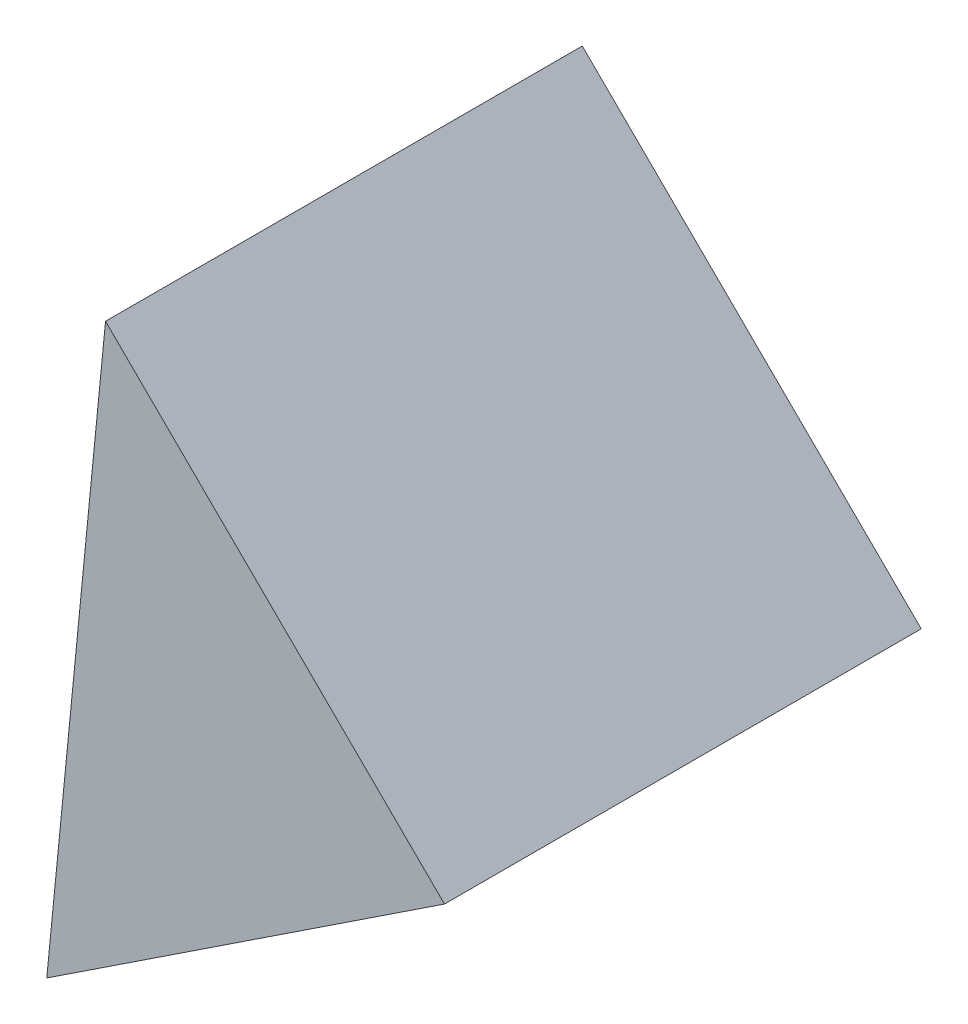
ISO-10303-21;
HEADER;
FILE_DESCRIPTION(('STEP AP214'),'2;1');
FILE_NAME('part.step','',(''),(''),'','','');
FILE_SCHEMA(('AUTOMOTIVE_DESIGN { 1 0 10303 214 1 1 1 1 }'));
ENDSEC;
DATA;
#1=APPLICATION_CONTEXT('core data for automotive mechanical design processes');
#2=APPLICATION_PROTOCOL_DEFINITION('international standard','automotive_design',2000,#1);
#3=PRODUCT_CONTEXT('',#1,'mechanical');
#4=PRODUCT('Part','Part','',(#3));
#5=PRODUCT_RELATED_PRODUCT_CATEGORY('part','',(#4));
#6=PRODUCT_DEFINITION_FORMATION('','',#4);
#7=PRODUCT_DEFINITION_CONTEXT('part definition',#1,'design');
#8=PRODUCT_DEFINITION('design','',#6,#7);
#9=PRODUCT_DEFINITION_SHAPE('','',#8);
#10=(LENGTH_UNIT() NAMED_UNIT(*) SI_UNIT(.MILLI.,.METRE.));
#11=(NAMED_UNIT(*) PLANE_ANGLE_UNIT() SI_UNIT($,.RADIAN.));
#12=(NAMED_UNIT(*) SI_UNIT($,.STERADIAN.) SOLID_ANGLE_UNIT());
#13=UNCERTAINTY_MEASURE_WITH_UNIT(LENGTH_MEASURE(1.E-05),#10,'distance_accuracy_value','');
#14=(GEOMETRIC_REPRESENTATION_CONTEXT(3) GLOBAL_UNCERTAINTY_ASSIGNED_CONTEXT((#13)) GLOBAL_UNIT_ASSIGNED_CONTEXT((#10,
#11,#12)) REPRESENTATION_CONTEXT('',''));
#15=CARTESIAN_POINT('',(0.,0.,0.));
#16=DIRECTION('',(0.,0.,1.));
#17=DIRECTION('',(1.,0.,0.));
#18=AXIS2_PLACEMENT_3D('',#15,#16,#17);
#19=CARTESIAN_POINT('',(11.1141708210114,7.73999018006656,12.5));
#20=DIRECTION('',(-0.551401526003401,0.834239987726026,0.));
#21=DIRECTION('',(-0.834239987726026,-0.551401526003401,0.));
#22=AXIS2_PLACEMENT_3D('',#19,#20,#21);
#23=PLANE('',#22);
#24=DIRECTION('',(0.834239987726026,0.551401526003401,0.));
#25=VECTOR('',#24,1.);
#26=CARTESIAN_POINT('',(11.1141708210114,7.73999018006656,0.));
#27=LINE('',#26,#25);
#28=CARTESIAN_POINT('',(0.686170974436035,0.847471105024041,0.));
#29=VERTEX_POINT('',#28);
#30=CARTESIAN_POINT('',(11.1141708210114,7.73999018006656,0.));
#31=VERTEX_POINT('',#30);
#32=EDGE_CURVE('E82',#29,#31,#27,.T.);
#33=ORIENTED_EDGE('',*,*,#32,.T.);
#34=DIRECTION('',(0.,0.,-1.));
#35=VECTOR('',#34,1.);
#36=CARTESIAN_POINT('',(11.1141708210114,7.73999018006656,12.5));
#37=LINE('',#36,#35);
#38=CARTESIAN_POINT('',(11.1141708210114,7.73999018006656,12.5));
#39=VERTEX_POINT('',#38);
#40=EDGE_CURVE('E11',#39,#31,#37,.T.);
#41=ORIENTED_EDGE('',*,*,#40,.F.);
#42=DIRECTION('',(0.834239987726026,0.551401526003401,0.));
#43=VECTOR('',#42,1.);
#44=CARTESIAN_POINT('',(11.1141708210114,7.73999018006656,12.5));
#45=LINE('',#44,#43);
#46=CARTESIAN_POINT('',(0.686170974436035,0.847471105024041,12.5));
#47=VERTEX_POINT('',#46);
#48=EDGE_CURVE('E75',#47,#39,#45,.T.);
#49=ORIENTED_EDGE('',*,*,#48,.F.);
#50=DIRECTION('',(0.,0.,-1.));
#51=VECTOR('',#50,1.);
#52=CARTESIAN_POINT('',(0.686170974436035,0.847471105024041,12.5));
#53=LINE('',#52,#51);
#54=EDGE_CURVE('E83',#47,#29,#53,.T.);
#55=ORIENTED_EDGE('',*,*,#54,.T.);
#56=EDGE_LOOP('',(#33,#41,#49,#55));
#57=FACE_BOUND('',#56,.T.);
#58=ADVANCED_FACE('F35',(#57),#23,.F.);
#59=CARTESIAN_POINT('',(11.1141708210114,7.73999018006656,12.5));
#60=DIRECTION('',(-0.703219485005664,-0.710972823607463,0.));
#61=DIRECTION('',(0.710972823607463,-0.703219485005664,0.));
#62=AXIS2_PLACEMENT_3D('',#59,#60,#61);
#63=PLANE('',#62);
#64=DIRECTION('',(-0.710972823607463,0.703219485005664,0.));
#65=VECTOR('',#64,1.);
#66=CARTESIAN_POINT('',(11.1141708210114,7.73999018006656,0.));
#67=LINE('',#66,#65);
#68=CARTESIAN_POINT('',(2.22701052591808,16.5302337426374,0.));
#69=VERTEX_POINT('',#68);
#70=EDGE_CURVE('E63',#31,#69,#67,.T.);
#71=ORIENTED_EDGE('',*,*,#70,.T.);
#72=DIRECTION('',(0.,0.,-1.));
#73=VECTOR('',#72,1.);
#74=CARTESIAN_POINT('',(2.22701052591808,16.5302337426374,12.5));
#75=LINE('',#74,#73);
#76=CARTESIAN_POINT('',(2.22701052591808,16.5302337426374,12.5));
#77=VERTEX_POINT('',#76);
#78=EDGE_CURVE('E43',#77,#69,#75,.T.);
#79=ORIENTED_EDGE('',*,*,#78,.F.);
#80=DIRECTION('',(-0.710972823607463,0.703219485005664,0.));
#81=VECTOR('',#80,1.);
#82=CARTESIAN_POINT('',(11.1141708210114,7.73999018006656,12.5));
#83=LINE('',#82,#81);
#84=EDGE_CURVE('E71',#39,#77,#83,.T.);
#85=ORIENTED_EDGE('',*,*,#84,.F.);
#86=ORIENTED_EDGE('',*,*,#40,.T.);
#87=EDGE_LOOP('',(#71,#79,#85,#86));
#88=FACE_BOUND('',#87,.T.);
#89=ADVANCED_FACE('F72',(#88),#63,.F.);
#90=CARTESIAN_POINT('',(0.686170974436035,0.847471105024041,12.5));
#91=DIRECTION('',(0.995208082962372,-0.0977797095841539,0.));
#92=DIRECTION('',(0.0977797095841539,0.995208082962372,0.));
#93=AXIS2_PLACEMENT_3D('',#90,#91,#92);
#94=PLANE('',#93);
#95=DIRECTION('',(-0.0977797095841539,-0.995208082962372,0.));
#96=VECTOR('',#95,1.);
#97=CARTESIAN_POINT('',(0.686170974436035,0.847471105024041,0.));
#98=LINE('',#97,#96);
#99=EDGE_CURVE('E68',#69,#29,#98,.T.);
#100=ORIENTED_EDGE('',*,*,#99,.T.);
#101=ORIENTED_EDGE('',*,*,#54,.F.);
#102=DIRECTION('',(-0.0977797095841539,-0.995208082962372,0.));
#103=VECTOR('',#102,1.);
#104=CARTESIAN_POINT('',(0.686170974436035,0.847471105024041,12.5));
#105=LINE('',#104,#103);
#106=EDGE_CURVE('E51',#77,#47,#105,.T.);
#107=ORIENTED_EDGE('',*,*,#106,.F.);
#108=ORIENTED_EDGE('',*,*,#78,.T.);
#109=EDGE_LOOP('',(#100,#101,#107,#108));
#110=FACE_BOUND('',#109,.T.);
#111=ADVANCED_FACE('F90',(#110),#94,.F.);
#112=CARTESIAN_POINT('',(0.,0.,12.5));
#113=DIRECTION('',(0.,0.,-1.));
#114=DIRECTION('',(-1.,0.,0.));
#115=AXIS2_PLACEMENT_3D('',#112,#113,#114);
#116=PLANE('',#115);
#117=ORIENTED_EDGE('',*,*,#48,.T.);
#118=ORIENTED_EDGE('',*,*,#84,.T.);
#119=ORIENTED_EDGE('',*,*,#106,.T.);
#120=EDGE_LOOP('',(#117,#118,#119));
#121=FACE_BOUND('',#120,.T.);
#122=ADVANCED_FACE('F78',(#121),#116,.F.);
#123=CARTESIAN_POINT('',(0.,0.,0.));
#124=DIRECTION('',(0.,0.,-1.));
#125=DIRECTION('',(-1.,0.,0.));
#126=AXIS2_PLACEMENT_3D('',#123,#124,#125);
#127=PLANE('',#126);
#128=ORIENTED_EDGE('',*,*,#32,.F.);
#129=ORIENTED_EDGE('',*,*,#99,.F.);
#130=ORIENTED_EDGE('',*,*,#70,.F.);
#131=EDGE_LOOP('',(#128,#129,#130));
#132=FACE_BOUND('',#131,.T.);
#133=ADVANCED_FACE('F91',(#132),#127,.T.);
#134=CLOSED_SHELL('',(#58,#89,#111,#122,#133));
#135=MANIFOLD_SOLID_BREP('B2',#134);
#136=ADVANCED_BREP_SHAPE_REPRESENTATION('',(#18,#135),#14);
#137=SHAPE_DEFINITION_REPRESENTATION(#9,#136);
ENDSEC;
END-ISO-10303-21;
